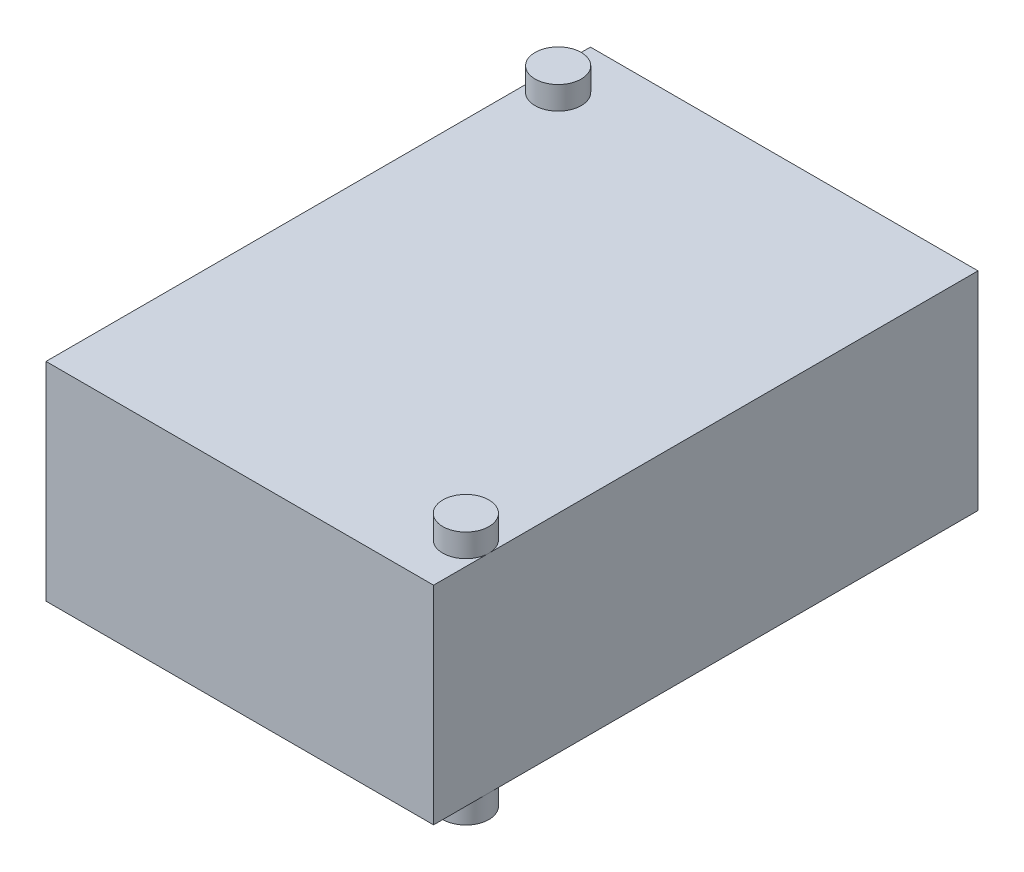
ISO-10303-21;
HEADER;
FILE_DESCRIPTION(('STEP AP214'),'2;1');
FILE_NAME('part.step','',(''),(''),'','','');
FILE_SCHEMA(('AUTOMOTIVE_DESIGN { 1 0 10303 214 1 1 1 1 }'));
ENDSEC;
DATA;
#1=APPLICATION_CONTEXT('core data for automotive mechanical design processes');
#2=APPLICATION_PROTOCOL_DEFINITION('international standard','automotive_design',2000,#1);
#3=PRODUCT_CONTEXT('',#1,'mechanical');
#4=PRODUCT('Part','Part','',(#3));
#5=PRODUCT_RELATED_PRODUCT_CATEGORY('part','',(#4));
#6=PRODUCT_DEFINITION_FORMATION('','',#4);
#7=PRODUCT_DEFINITION_CONTEXT('part definition',#1,'design');
#8=PRODUCT_DEFINITION('design','',#6,#7);
#9=PRODUCT_DEFINITION_SHAPE('','',#8);
#10=(LENGTH_UNIT() NAMED_UNIT(*) SI_UNIT(.MILLI.,.METRE.));
#11=(NAMED_UNIT(*) PLANE_ANGLE_UNIT() SI_UNIT($,.RADIAN.));
#12=(NAMED_UNIT(*) SI_UNIT($,.STERADIAN.) SOLID_ANGLE_UNIT());
#13=UNCERTAINTY_MEASURE_WITH_UNIT(LENGTH_MEASURE(1.E-05),#10,'distance_accuracy_value','');
#14=(GEOMETRIC_REPRESENTATION_CONTEXT(3) GLOBAL_UNCERTAINTY_ASSIGNED_CONTEXT((#13)) GLOBAL_UNIT_ASSIGNED_CONTEXT((#10,
#11,#12)) REPRESENTATION_CONTEXT('',''));
#15=CARTESIAN_POINT('',(0.,0.,0.));
#16=DIRECTION('',(0.,0.,1.));
#17=DIRECTION('',(1.,0.,0.));
#18=AXIS2_PLACEMENT_3D('',#15,#16,#17);
#19=CARTESIAN_POINT('',(-4.2,0.,-5.9));
#20=DIRECTION('',(-1.,0.,0.));
#21=DIRECTION('',(0.,-1.,0.));
#22=AXIS2_PLACEMENT_3D('',#19,#20,#21);
#23=PLANE('',#22);
#24=DIRECTION('',(0.,0.,1.));
#25=VECTOR('',#24,1.);
#26=CARTESIAN_POINT('',(-4.2,4.5,-5.9));
#27=LINE('',#26,#25);
#28=CARTESIAN_POINT('',(-4.2,4.5,-4.7));
#29=VERTEX_POINT('',#28);
#30=CARTESIAN_POINT('',(-4.2,4.5,5.9));
#31=VERTEX_POINT('',#30);
#32=EDGE_CURVE('E110',#29,#31,#27,.T.);
#33=ORIENTED_EDGE('',*,*,#32,.F.);
#34=CARTESIAN_POINT('',(-4.2,4.5,-5.9));
#35=VERTEX_POINT('',#34);
#36=EDGE_CURVE('E46',#35,#29,#27,.T.);
#37=ORIENTED_EDGE('',*,*,#36,.F.);
#38=DIRECTION('',(0.,-1.,0.));
#39=VECTOR('',#38,1.);
#40=CARTESIAN_POINT('',(-4.2,0.,-5.9));
#41=LINE('',#40,#39);
#42=CARTESIAN_POINT('',(-4.2,0.,-5.9));
#43=VERTEX_POINT('',#42);
#44=EDGE_CURVE('E118',#35,#43,#41,.T.);
#45=ORIENTED_EDGE('',*,*,#44,.T.);
#46=DIRECTION('',(0.,0.,1.));
#47=VECTOR('',#46,1.);
#48=CARTESIAN_POINT('',(-4.2,0.,-5.9));
#49=LINE('',#48,#47);
#50=CARTESIAN_POINT('',(-4.2,0.,-4.7));
#51=VERTEX_POINT('',#50);
#52=EDGE_CURVE('E102',#43,#51,#49,.T.);
#53=ORIENTED_EDGE('',*,*,#52,.T.);
#54=CARTESIAN_POINT('',(-4.2,0.,5.9));
#55=VERTEX_POINT('',#54);
#56=EDGE_CURVE('E103',#51,#55,#49,.T.);
#57=ORIENTED_EDGE('',*,*,#56,.T.);
#58=DIRECTION('',(0.,-1.,0.));
#59=VECTOR('',#58,1.);
#60=CARTESIAN_POINT('',(-4.2,0.,5.9));
#61=LINE('',#60,#59);
#62=EDGE_CURVE('E126',#31,#55,#61,.T.);
#63=ORIENTED_EDGE('',*,*,#62,.F.);
#64=EDGE_LOOP('',(#33,#37,#45,#53,#57,#63));
#65=FACE_BOUND('',#64,.T.);
#66=ADVANCED_FACE('F32',(#65),#23,.T.);
#67=CARTESIAN_POINT('',(-4.2,4.5,-5.9));
#68=DIRECTION('',(0.,1.,0.));
#69=DIRECTION('',(-1.,0.,0.));
#70=AXIS2_PLACEMENT_3D('',#67,#68,#69);
#71=PLANE('',#70);
#72=DIRECTION('',(0.,0.,1.));
#73=VECTOR('',#72,1.);
#74=CARTESIAN_POINT('',(4.2,4.5,-5.9));
#75=LINE('',#74,#73);
#76=CARTESIAN_POINT('',(4.2,4.5,4.7));
#77=VERTEX_POINT('',#76);
#78=CARTESIAN_POINT('',(4.2,4.5,5.9));
#79=VERTEX_POINT('',#78);
#80=EDGE_CURVE('E93',#77,#79,#75,.T.);
#81=ORIENTED_EDGE('',*,*,#80,.F.);
#82=CARTESIAN_POINT('',(3.7,4.5,4.7));
#83=DIRECTION('',(0.,1.,0.));
#84=DIRECTION('',(-1.,0.,0.));
#85=AXIS2_PLACEMENT_3D('',#82,#83,#84);
#86=CIRCLE('',#85,0.5);
#87=EDGE_CURVE('E138',#77,#77,#86,.T.);
#88=ORIENTED_EDGE('',*,*,#87,.F.);
#89=CARTESIAN_POINT('',(4.2,4.5,-5.9));
#90=VERTEX_POINT('',#89);
#91=EDGE_CURVE('E54',#90,#77,#75,.T.);
#92=ORIENTED_EDGE('',*,*,#91,.F.);
#93=DIRECTION('',(-1.,0.,0.));
#94=VECTOR('',#93,1.);
#95=CARTESIAN_POINT('',(-4.2,4.5,-5.9));
#96=LINE('',#95,#94);
#97=EDGE_CURVE('E113',#90,#35,#96,.T.);
#98=ORIENTED_EDGE('',*,*,#97,.T.);
#99=ORIENTED_EDGE('',*,*,#36,.T.);
#100=CARTESIAN_POINT('',(-3.7,4.5,-4.7));
#101=DIRECTION('',(0.,1.,0.));
#102=DIRECTION('',(-1.,0.,0.));
#103=AXIS2_PLACEMENT_3D('',#100,#101,#102);
#104=CIRCLE('',#103,0.5);
#105=EDGE_CURVE('E129',#29,#29,#104,.T.);
#106=ORIENTED_EDGE('',*,*,#105,.F.);
#107=ORIENTED_EDGE('',*,*,#32,.T.);
#108=DIRECTION('',(-1.,0.,0.));
#109=VECTOR('',#108,1.);
#110=CARTESIAN_POINT('',(-4.2,4.5,5.9));
#111=LINE('',#110,#109);
#112=EDGE_CURVE('E120',#79,#31,#111,.T.);
#113=ORIENTED_EDGE('',*,*,#112,.F.);
#114=EDGE_LOOP('',(#81,#88,#92,#98,#99,#106,#107,#113));
#115=FACE_BOUND('',#114,.T.);
#116=ADVANCED_FACE('F165',(#115),#71,.T.);
#117=CARTESIAN_POINT('',(4.2,0.,-5.9));
#118=DIRECTION('',(1.,0.,0.));
#119=DIRECTION('',(0.,1.,0.));
#120=AXIS2_PLACEMENT_3D('',#117,#118,#119);
#121=PLANE('',#120);
#122=ORIENTED_EDGE('',*,*,#91,.T.);
#123=ORIENTED_EDGE('',*,*,#80,.T.);
#124=DIRECTION('',(0.,1.,0.));
#125=VECTOR('',#124,1.);
#126=CARTESIAN_POINT('',(4.2,0.,5.9));
#127=LINE('',#126,#125);
#128=CARTESIAN_POINT('',(4.2,0.,5.9));
#129=VERTEX_POINT('',#128);
#130=EDGE_CURVE('E99',#129,#79,#127,.T.);
#131=ORIENTED_EDGE('',*,*,#130,.F.);
#132=DIRECTION('',(0.,0.,1.));
#133=VECTOR('',#132,1.);
#134=CARTESIAN_POINT('',(4.2,0.,-5.9));
#135=LINE('',#134,#133);
#136=CARTESIAN_POINT('',(4.2,0.,4.7));
#137=VERTEX_POINT('',#136);
#138=EDGE_CURVE('E94',#137,#129,#135,.T.);
#139=ORIENTED_EDGE('',*,*,#138,.F.);
#140=CARTESIAN_POINT('',(4.2,0.,-5.9));
#141=VERTEX_POINT('',#140);
#142=EDGE_CURVE('E86',#141,#137,#135,.T.);
#143=ORIENTED_EDGE('',*,*,#142,.F.);
#144=DIRECTION('',(0.,1.,0.));
#145=VECTOR('',#144,1.);
#146=CARTESIAN_POINT('',(4.2,0.,-5.9));
#147=LINE('',#146,#145);
#148=EDGE_CURVE('E115',#141,#90,#147,.T.);
#149=ORIENTED_EDGE('',*,*,#148,.T.);
#150=EDGE_LOOP('',(#122,#123,#131,#139,#143,#149));
#151=FACE_BOUND('',#150,.T.);
#152=ADVANCED_FACE('F97',(#151),#121,.T.);
#153=CARTESIAN_POINT('',(-4.2,0.,-5.9));
#154=DIRECTION('',(0.,-1.,0.));
#155=DIRECTION('',(1.,0.,0.));
#156=AXIS2_PLACEMENT_3D('',#153,#154,#155);
#157=PLANE('',#156);
#158=ORIENTED_EDGE('',*,*,#142,.T.);
#159=CARTESIAN_POINT('',(3.7,0.,4.7));
#160=DIRECTION('',(0.,-1.,0.));
#161=DIRECTION('',(1.,0.,0.));
#162=AXIS2_PLACEMENT_3D('',#159,#160,#161);
#163=CIRCLE('',#162,0.5);
#164=EDGE_CURVE('E11',#137,#137,#163,.T.);
#165=ORIENTED_EDGE('',*,*,#164,.F.);
#166=ORIENTED_EDGE('',*,*,#138,.T.);
#167=DIRECTION('',(1.,0.,0.));
#168=VECTOR('',#167,1.);
#169=CARTESIAN_POINT('',(-4.2,0.,5.9));
#170=LINE('',#169,#168);
#171=EDGE_CURVE('E124',#55,#129,#170,.T.);
#172=ORIENTED_EDGE('',*,*,#171,.F.);
#173=ORIENTED_EDGE('',*,*,#56,.F.);
#174=CARTESIAN_POINT('',(-3.7,0.,-4.7));
#175=DIRECTION('',(0.,-1.,0.));
#176=DIRECTION('',(1.,0.,0.));
#177=AXIS2_PLACEMENT_3D('',#174,#175,#176);
#178=CIRCLE('',#177,0.5);
#179=EDGE_CURVE('E39',#51,#51,#178,.T.);
#180=ORIENTED_EDGE('',*,*,#179,.F.);
#181=ORIENTED_EDGE('',*,*,#52,.F.);
#182=DIRECTION('',(1.,0.,0.));
#183=VECTOR('',#182,1.);
#184=CARTESIAN_POINT('',(-4.2,0.,-5.9));
#185=LINE('',#184,#183);
#186=EDGE_CURVE('E90',#43,#141,#185,.T.);
#187=ORIENTED_EDGE('',*,*,#186,.T.);
#188=EDGE_LOOP('',(#158,#165,#166,#172,#173,#180,#181,#187));
#189=FACE_BOUND('',#188,.T.);
#190=ADVANCED_FACE('F88',(#189),#157,.T.);
#191=CARTESIAN_POINT('',(0.,0.,-5.9));
#192=DIRECTION('',(0.,0.,-1.));
#193=DIRECTION('',(-1.,0.,0.));
#194=AXIS2_PLACEMENT_3D('',#191,#192,#193);
#195=PLANE('',#194);
#196=ORIENTED_EDGE('',*,*,#44,.F.);
#197=ORIENTED_EDGE('',*,*,#97,.F.);
#198=ORIENTED_EDGE('',*,*,#148,.F.);
#199=ORIENTED_EDGE('',*,*,#186,.F.);
#200=EDGE_LOOP('',(#196,#197,#198,#199));
#201=FACE_BOUND('',#200,.T.);
#202=ADVANCED_FACE('F196',(#201),#195,.T.);
#203=CARTESIAN_POINT('',(0.,0.,5.9));
#204=DIRECTION('',(0.,0.,-1.));
#205=DIRECTION('',(-1.,0.,0.));
#206=AXIS2_PLACEMENT_3D('',#203,#204,#205);
#207=PLANE('',#206);
#208=ORIENTED_EDGE('',*,*,#62,.T.);
#209=ORIENTED_EDGE('',*,*,#171,.T.);
#210=ORIENTED_EDGE('',*,*,#130,.T.);
#211=ORIENTED_EDGE('',*,*,#112,.T.);
#212=EDGE_LOOP('',(#208,#209,#210,#211));
#213=FACE_BOUND('',#212,.T.);
#214=ADVANCED_FACE('F190',(#213),#207,.F.);
#215=CARTESIAN_POINT('',(-3.7,-0.5,-4.7));
#216=DIRECTION('',(0.,1.,0.));
#217=DIRECTION('',(-1.,0.,0.));
#218=AXIS2_PLACEMENT_3D('',#215,#216,#217);
#219=PLANE('',#218);
#220=CARTESIAN_POINT('',(-3.7,-0.5,-4.7));
#221=DIRECTION('',(0.,1.,0.));
#222=DIRECTION('',(-1.,0.,0.));
#223=AXIS2_PLACEMENT_3D('',#220,#221,#222);
#224=CIRCLE('',#223,0.5);
#225=CARTESIAN_POINT('',(-4.2,-0.5,-4.7));
#226=VERTEX_POINT('',#225);
#227=EDGE_CURVE('E132',#226,#226,#224,.T.);
#228=ORIENTED_EDGE('',*,*,#227,.F.);
#229=EDGE_LOOP('',(#228));
#230=FACE_BOUND('',#229,.T.);
#231=ADVANCED_FACE('F188',(#230),#219,.F.);
#232=CARTESIAN_POINT('',(-3.7,-0.5,-4.7));
#233=DIRECTION('',(0.,1.,0.));
#234=DIRECTION('',(-1.,0.,0.));
#235=AXIS2_PLACEMENT_3D('',#232,#233,#234);
#236=CYLINDRICAL_SURFACE('',#235,0.5);
#237=ORIENTED_EDGE('',*,*,#179,.T.);
#238=EDGE_LOOP('',(#237));
#239=FACE_BOUND('',#238,.T.);
#240=ORIENTED_EDGE('',*,*,#227,.T.);
#241=EDGE_LOOP('',(#240));
#242=FACE_BOUND('',#241,.T.);
#243=ADVANCED_FACE('F178',(#239,#242),#236,.T.);
#244=ORIENTED_EDGE('',*,*,#105,.T.);
#245=EDGE_LOOP('',(#244));
#246=FACE_BOUND('',#245,.T.);
#247=CARTESIAN_POINT('',(-3.7,5.,-4.7));
#248=DIRECTION('',(0.,1.,0.));
#249=DIRECTION('',(-1.,0.,0.));
#250=AXIS2_PLACEMENT_3D('',#247,#248,#249);
#251=CIRCLE('',#250,0.5);
#252=CARTESIAN_POINT('',(-4.2,5.,-4.7));
#253=VERTEX_POINT('',#252);
#254=EDGE_CURVE('E135',#253,#253,#251,.T.);
#255=ORIENTED_EDGE('',*,*,#254,.F.);
#256=EDGE_LOOP('',(#255));
#257=FACE_BOUND('',#256,.T.);
#258=ADVANCED_FACE('F174',(#246,#257),#236,.T.);
#259=CARTESIAN_POINT('',(-3.7,5.,-4.7));
#260=DIRECTION('',(0.,1.,0.));
#261=DIRECTION('',(-1.,0.,0.));
#262=AXIS2_PLACEMENT_3D('',#259,#260,#261);
#263=PLANE('',#262);
#264=ORIENTED_EDGE('',*,*,#254,.T.);
#265=EDGE_LOOP('',(#264));
#266=FACE_BOUND('',#265,.T.);
#267=ADVANCED_FACE('F177',(#266),#263,.T.);
#268=CARTESIAN_POINT('',(3.7,-0.5,4.7));
#269=DIRECTION('',(0.,1.,0.));
#270=DIRECTION('',(-1.,0.,0.));
#271=AXIS2_PLACEMENT_3D('',#268,#269,#270);
#272=PLANE('',#271);
#273=CARTESIAN_POINT('',(3.7,-0.5,4.7));
#274=DIRECTION('',(0.,1.,0.));
#275=DIRECTION('',(-1.,0.,0.));
#276=AXIS2_PLACEMENT_3D('',#273,#274,#275);
#277=CIRCLE('',#276,0.5);
#278=CARTESIAN_POINT('',(3.2,-0.5,4.7));
#279=VERTEX_POINT('',#278);
#280=EDGE_CURVE('E141',#279,#279,#277,.T.);
#281=ORIENTED_EDGE('',*,*,#280,.F.);
#282=EDGE_LOOP('',(#281));
#283=FACE_BOUND('',#282,.T.);
#284=ADVANCED_FACE('F160',(#283),#272,.F.);
#285=CARTESIAN_POINT('',(3.7,-0.5,4.7));
#286=DIRECTION('',(0.,1.,0.));
#287=DIRECTION('',(-1.,0.,0.));
#288=AXIS2_PLACEMENT_3D('',#285,#286,#287);
#289=CYLINDRICAL_SURFACE('',#288,0.5);
#290=ORIENTED_EDGE('',*,*,#164,.T.);
#291=EDGE_LOOP('',(#290));
#292=FACE_BOUND('',#291,.T.);
#293=ORIENTED_EDGE('',*,*,#280,.T.);
#294=EDGE_LOOP('',(#293));
#295=FACE_BOUND('',#294,.T.);
#296=ADVANCED_FACE('F152',(#292,#295),#289,.T.);
#297=ORIENTED_EDGE('',*,*,#87,.T.);
#298=EDGE_LOOP('',(#297));
#299=FACE_BOUND('',#298,.T.);
#300=CARTESIAN_POINT('',(3.7,5.,4.7));
#301=DIRECTION('',(0.,1.,0.));
#302=DIRECTION('',(-1.,0.,0.));
#303=AXIS2_PLACEMENT_3D('',#300,#301,#302);
#304=CIRCLE('',#303,0.5);
#305=CARTESIAN_POINT('',(3.2,5.,4.7));
#306=VERTEX_POINT('',#305);
#307=EDGE_CURVE('E144',#306,#306,#304,.T.);
#308=ORIENTED_EDGE('',*,*,#307,.F.);
#309=EDGE_LOOP('',(#308));
#310=FACE_BOUND('',#309,.T.);
#311=ADVANCED_FACE('F150',(#299,#310),#289,.T.);
#312=CARTESIAN_POINT('',(3.7,5.,4.7));
#313=DIRECTION('',(0.,1.,0.));
#314=DIRECTION('',(-1.,0.,0.));
#315=AXIS2_PLACEMENT_3D('',#312,#313,#314);
#316=PLANE('',#315);
#317=ORIENTED_EDGE('',*,*,#307,.T.);
#318=EDGE_LOOP('',(#317));
#319=FACE_BOUND('',#318,.T.);
#320=ADVANCED_FACE('F148',(#319),#316,.T.);
#321=CLOSED_SHELL('',(#66,#116,#152,#190,#202,#214,#231,#243,#258,#267,#284,#296,#311,#320));
#322=MANIFOLD_SOLID_BREP('B2',#321);
#323=ADVANCED_BREP_SHAPE_REPRESENTATION('',(#18,#322),#14);
#324=SHAPE_DEFINITION_REPRESENTATION(#9,#323);
ENDSEC;
END-ISO-10303-21;
